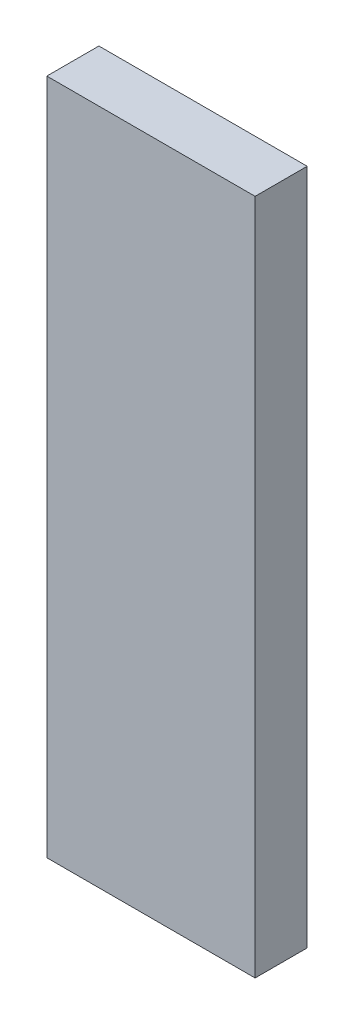
ISO-10303-21;
HEADER;
FILE_DESCRIPTION(('STEP AP214'),'2;1');
FILE_NAME('part.step','',(''),(''),'','','');
FILE_SCHEMA(('AUTOMOTIVE_DESIGN { 1 0 10303 214 1 1 1 1 }'));
ENDSEC;
DATA;
#1=APPLICATION_CONTEXT('core data for automotive mechanical design processes');
#2=APPLICATION_PROTOCOL_DEFINITION('international standard','automotive_design',2000,#1);
#3=PRODUCT_CONTEXT('',#1,'mechanical');
#4=PRODUCT('Part','Part','',(#3));
#5=PRODUCT_RELATED_PRODUCT_CATEGORY('part','',(#4));
#6=PRODUCT_DEFINITION_FORMATION('','',#4);
#7=PRODUCT_DEFINITION_CONTEXT('part definition',#1,'design');
#8=PRODUCT_DEFINITION('design','',#6,#7);
#9=PRODUCT_DEFINITION_SHAPE('','',#8);
#10=(LENGTH_UNIT() NAMED_UNIT(*) SI_UNIT(.MILLI.,.METRE.));
#11=(NAMED_UNIT(*) PLANE_ANGLE_UNIT() SI_UNIT($,.RADIAN.));
#12=(NAMED_UNIT(*) SI_UNIT($,.STERADIAN.) SOLID_ANGLE_UNIT());
#13=UNCERTAINTY_MEASURE_WITH_UNIT(LENGTH_MEASURE(1.E-05),#10,'distance_accuracy_value','');
#14=(GEOMETRIC_REPRESENTATION_CONTEXT(3) GLOBAL_UNCERTAINTY_ASSIGNED_CONTEXT((#13)) GLOBAL_UNIT_ASSIGNED_CONTEXT((#10,
#11,#12)) REPRESENTATION_CONTEXT('',''));
#15=CARTESIAN_POINT('',(0.,0.,0.));
#16=DIRECTION('',(0.,0.,1.));
#17=DIRECTION('',(1.,0.,0.));
#18=AXIS2_PLACEMENT_3D('',#15,#16,#17);
#19=CARTESIAN_POINT('',(-0.1999996,-0.6499987,0.1));
#20=DIRECTION('',(0.,0.,1.));
#21=DIRECTION('',(1.,0.,0.));
#22=AXIS2_PLACEMENT_3D('',#19,#20,#21);
#23=PLANE('',#22);
#24=DIRECTION('',(1.,0.,0.));
#25=VECTOR('',#24,1.);
#26=CARTESIAN_POINT('',(-0.1999996,0.65000124,0.1));
#27=LINE('',#26,#25);
#28=CARTESIAN_POINT('',(-0.1999996,0.65000124,0.1));
#29=VERTEX_POINT('',#28);
#30=CARTESIAN_POINT('',(0.20000214,0.65000124,0.1));
#31=VERTEX_POINT('',#30);
#32=EDGE_CURVE('E53',#29,#31,#27,.T.);
#33=ORIENTED_EDGE('',*,*,#32,.F.);
#34=DIRECTION('',(0.,1.,0.));
#35=VECTOR('',#34,1.);
#36=CARTESIAN_POINT('',(-0.1999996,-0.6499987,0.1));
#37=LINE('',#36,#35);
#38=CARTESIAN_POINT('',(-0.1999996,-0.6499987,0.1));
#39=VERTEX_POINT('',#38);
#40=EDGE_CURVE('E69',#39,#29,#37,.T.);
#41=ORIENTED_EDGE('',*,*,#40,.F.);
#42=DIRECTION('',(1.,0.,0.));
#43=VECTOR('',#42,1.);
#44=CARTESIAN_POINT('',(0.20000214,-0.6499987,0.1));
#45=LINE('',#44,#43);
#46=CARTESIAN_POINT('',(0.20000214,-0.6499987,0.1));
#47=VERTEX_POINT('',#46);
#48=EDGE_CURVE('E19',#47,#39,#45,.F.);
#49=ORIENTED_EDGE('',*,*,#48,.F.);
#50=DIRECTION('',(0.,1.,0.));
#51=VECTOR('',#50,1.);
#52=CARTESIAN_POINT('',(0.20000214,0.65000124,0.1));
#53=LINE('',#52,#51);
#54=EDGE_CURVE('E58',#31,#47,#53,.F.);
#55=ORIENTED_EDGE('',*,*,#54,.F.);
#56=EDGE_LOOP('',(#33,#41,#49,#55));
#57=FACE_BOUND('',#56,.T.);
#58=ADVANCED_FACE('F16',(#57),#23,.T.);
#59=CARTESIAN_POINT('',(0.20000214,-0.6499987,0.));
#60=DIRECTION('',(0.,-1.,0.));
#61=DIRECTION('',(0.,0.,-1.));
#62=AXIS2_PLACEMENT_3D('',#59,#60,#61);
#63=PLANE('',#62);
#64=DIRECTION('',(0.,0.,1.));
#65=VECTOR('',#64,1.);
#66=CARTESIAN_POINT('',(-0.1999996,-0.6499987,0.));
#67=LINE('',#66,#65);
#68=CARTESIAN_POINT('',(-0.1999996,-0.6499987,0.));
#69=VERTEX_POINT('',#68);
#70=EDGE_CURVE('E88',#69,#39,#67,.T.);
#71=ORIENTED_EDGE('',*,*,#70,.F.);
#72=DIRECTION('',(1.,0.,0.));
#73=VECTOR('',#72,1.);
#74=CARTESIAN_POINT('',(-0.1999996,-0.6499987,0.));
#75=LINE('',#74,#73);
#76=CARTESIAN_POINT('',(0.20000214,-0.6499987,0.));
#77=VERTEX_POINT('',#76);
#78=EDGE_CURVE('E76',#69,#77,#75,.T.);
#79=ORIENTED_EDGE('',*,*,#78,.T.);
#80=DIRECTION('',(0.,0.,-1.));
#81=VECTOR('',#80,1.);
#82=CARTESIAN_POINT('',(0.20000214,-0.6499987,0.));
#83=LINE('',#82,#81);
#84=EDGE_CURVE('E63',#47,#77,#83,.T.);
#85=ORIENTED_EDGE('',*,*,#84,.F.);
#86=ORIENTED_EDGE('',*,*,#48,.T.);
#87=EDGE_LOOP('',(#71,#79,#85,#86));
#88=FACE_BOUND('',#87,.T.);
#89=ADVANCED_FACE('F75',(#88),#63,.T.);
#90=CARTESIAN_POINT('',(0.20000214,0.65000124,0.));
#91=DIRECTION('',(1.,0.,0.));
#92=DIRECTION('',(0.,0.,-1.));
#93=AXIS2_PLACEMENT_3D('',#90,#91,#92);
#94=PLANE('',#93);
#95=ORIENTED_EDGE('',*,*,#84,.T.);
#96=DIRECTION('',(0.,1.,0.));
#97=VECTOR('',#96,1.);
#98=CARTESIAN_POINT('',(0.20000214,-0.6499987,0.));
#99=LINE('',#98,#97);
#100=CARTESIAN_POINT('',(0.20000214,0.65000124,0.));
#101=VERTEX_POINT('',#100);
#102=EDGE_CURVE('E96',#77,#101,#99,.T.);
#103=ORIENTED_EDGE('',*,*,#102,.T.);
#104=DIRECTION('',(0.,0.,1.));
#105=VECTOR('',#104,1.);
#106=CARTESIAN_POINT('',(0.20000214,0.65000124,0.));
#107=LINE('',#106,#105);
#108=EDGE_CURVE('E65',#31,#101,#107,.F.);
#109=ORIENTED_EDGE('',*,*,#108,.F.);
#110=ORIENTED_EDGE('',*,*,#54,.T.);
#111=EDGE_LOOP('',(#95,#103,#109,#110));
#112=FACE_BOUND('',#111,.T.);
#113=ADVANCED_FACE('F60',(#112),#94,.T.);
#114=CARTESIAN_POINT('',(-0.1999996,0.65000124,0.));
#115=DIRECTION('',(0.,1.,0.));
#116=DIRECTION('',(0.,0.,1.));
#117=AXIS2_PLACEMENT_3D('',#114,#115,#116);
#118=PLANE('',#117);
#119=ORIENTED_EDGE('',*,*,#108,.T.);
#120=DIRECTION('',(1.,0.,0.));
#121=VECTOR('',#120,1.);
#122=CARTESIAN_POINT('',(-0.1999996,0.65000124,0.));
#123=LINE('',#122,#121);
#124=CARTESIAN_POINT('',(-0.1999996,0.65000124,0.));
#125=VERTEX_POINT('',#124);
#126=EDGE_CURVE('E26',#101,#125,#123,.F.);
#127=ORIENTED_EDGE('',*,*,#126,.T.);
#128=DIRECTION('',(0.,0.,1.));
#129=VECTOR('',#128,1.);
#130=CARTESIAN_POINT('',(-0.1999996,0.65000124,0.));
#131=LINE('',#130,#129);
#132=EDGE_CURVE('E34',#29,#125,#131,.F.);
#133=ORIENTED_EDGE('',*,*,#132,.F.);
#134=ORIENTED_EDGE('',*,*,#32,.T.);
#135=EDGE_LOOP('',(#119,#127,#133,#134));
#136=FACE_BOUND('',#135,.T.);
#137=ADVANCED_FACE('F103',(#136),#118,.T.);
#138=CARTESIAN_POINT('',(-0.1999996,-0.6499987,0.));
#139=DIRECTION('',(-1.,0.,0.));
#140=DIRECTION('',(0.,0.,1.));
#141=AXIS2_PLACEMENT_3D('',#138,#139,#140);
#142=PLANE('',#141);
#143=ORIENTED_EDGE('',*,*,#132,.T.);
#144=DIRECTION('',(0.,1.,0.));
#145=VECTOR('',#144,1.);
#146=CARTESIAN_POINT('',(-0.1999996,-0.6499987,0.));
#147=LINE('',#146,#145);
#148=EDGE_CURVE('E11',#125,#69,#147,.F.);
#149=ORIENTED_EDGE('',*,*,#148,.T.);
#150=ORIENTED_EDGE('',*,*,#70,.T.);
#151=ORIENTED_EDGE('',*,*,#40,.T.);
#152=EDGE_LOOP('',(#143,#149,#150,#151));
#153=FACE_BOUND('',#152,.T.);
#154=ADVANCED_FACE('F106',(#153),#142,.T.);
#155=CARTESIAN_POINT('',(-0.1999996,-0.6499987,0.));
#156=DIRECTION('',(0.,0.,1.));
#157=DIRECTION('',(1.,0.,0.));
#158=AXIS2_PLACEMENT_3D('',#155,#156,#157);
#159=PLANE('',#158);
#160=ORIENTED_EDGE('',*,*,#126,.F.);
#161=ORIENTED_EDGE('',*,*,#102,.F.);
#162=ORIENTED_EDGE('',*,*,#78,.F.);
#163=ORIENTED_EDGE('',*,*,#148,.F.);
#164=EDGE_LOOP('',(#160,#161,#162,#163));
#165=FACE_BOUND('',#164,.T.);
#166=ADVANCED_FACE('F105',(#165),#159,.F.);
#167=CLOSED_SHELL('',(#58,#89,#113,#137,#154,#166));
#168=MANIFOLD_SOLID_BREP('B1',#167);
#169=ADVANCED_BREP_SHAPE_REPRESENTATION('',(#18,#168),#14);
#170=SHAPE_DEFINITION_REPRESENTATION(#9,#169);
ENDSEC;
END-ISO-10303-21;
